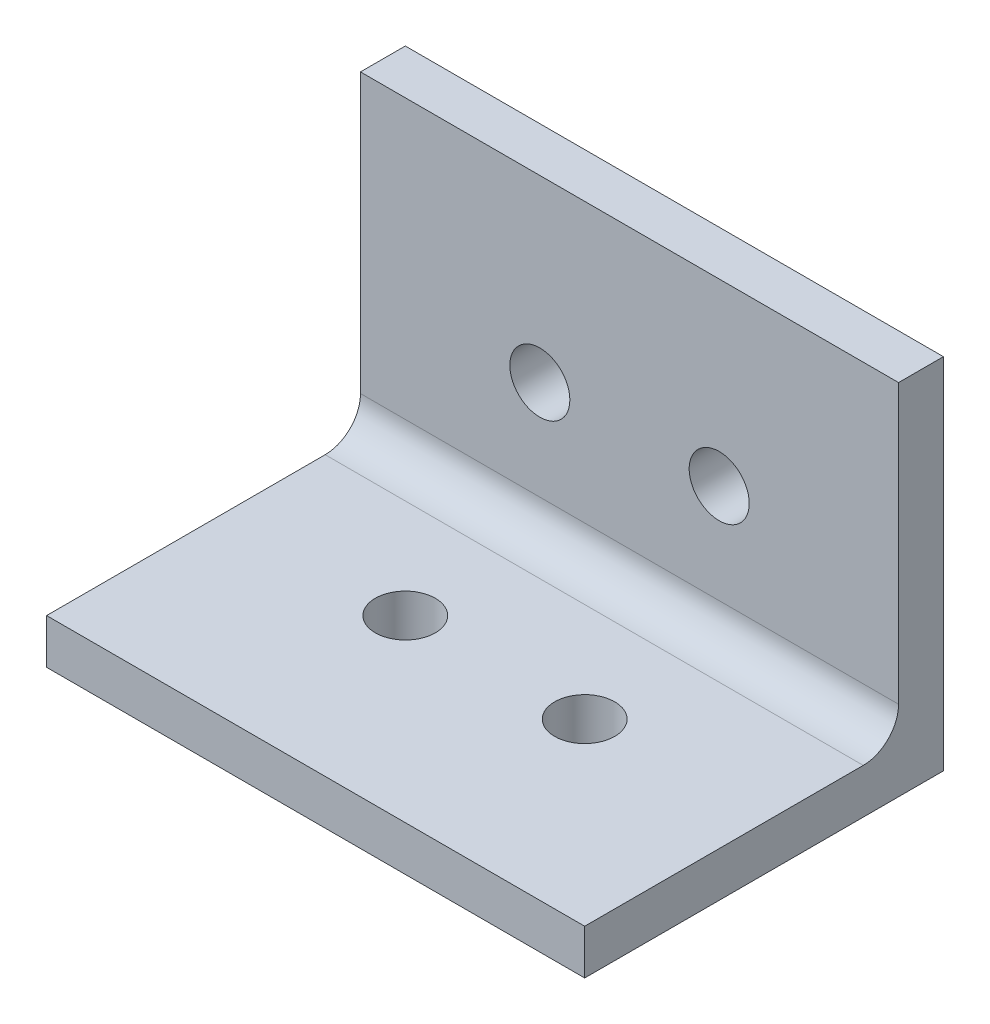
ISO-10303-21;
HEADER;
FILE_DESCRIPTION(('STEP AP214'),'2;1');
FILE_NAME('part.step','',(''),(''),'','','');
FILE_SCHEMA(('AUTOMOTIVE_DESIGN { 1 0 10303 214 1 1 1 1 }'));
ENDSEC;
DATA;
#1=APPLICATION_CONTEXT('core data for automotive mechanical design processes');
#2=APPLICATION_PROTOCOL_DEFINITION('international standard','automotive_design',2000,#1);
#3=PRODUCT_CONTEXT('',#1,'mechanical');
#4=PRODUCT('Part','Part','',(#3));
#5=PRODUCT_RELATED_PRODUCT_CATEGORY('part','',(#4));
#6=PRODUCT_DEFINITION_FORMATION('','',#4);
#7=PRODUCT_DEFINITION_CONTEXT('part definition',#1,'design');
#8=PRODUCT_DEFINITION('design','',#6,#7);
#9=PRODUCT_DEFINITION_SHAPE('','',#8);
#10=(LENGTH_UNIT() NAMED_UNIT(*) SI_UNIT(.MILLI.,.METRE.));
#11=(NAMED_UNIT(*) PLANE_ANGLE_UNIT() SI_UNIT($,.RADIAN.));
#12=(NAMED_UNIT(*) SI_UNIT($,.STERADIAN.) SOLID_ANGLE_UNIT());
#13=UNCERTAINTY_MEASURE_WITH_UNIT(LENGTH_MEASURE(1.E-05),#10,'distance_accuracy_value','');
#14=(GEOMETRIC_REPRESENTATION_CONTEXT(3) GLOBAL_UNCERTAINTY_ASSIGNED_CONTEXT((#13)) GLOBAL_UNIT_ASSIGNED_CONTEXT((#10,
#11,#12)) REPRESENTATION_CONTEXT('',''));
#15=CARTESIAN_POINT('',(0.,0.,0.));
#16=DIRECTION('',(0.,0.,1.));
#17=DIRECTION('',(1.,0.,0.));
#18=AXIS2_PLACEMENT_3D('',#15,#16,#17);
#19=CARTESIAN_POINT('',(76.2,0.,50.8));
#20=DIRECTION('',(0.,1.,0.));
#21=DIRECTION('',(0.,0.,1.));
#22=AXIS2_PLACEMENT_3D('',#19,#20,#21);
#23=PLANE('',#22);
#24=CARTESIAN_POINT('',(25.4,0.,25.4));
#25=DIRECTION('',(0.,1.,0.));
#26=DIRECTION('',(0.,0.,1.));
#27=AXIS2_PLACEMENT_3D('',#24,#25,#26);
#28=CIRCLE('',#27,4.25);
#29=CARTESIAN_POINT('',(25.4,0.,29.65));
#30=VERTEX_POINT('',#29);
#31=EDGE_CURVE('E153',#30,#30,#28,.T.);
#32=ORIENTED_EDGE('',*,*,#31,.T.);
#33=EDGE_LOOP('',(#32));
#34=FACE_BOUND('',#33,.T.);
#35=CARTESIAN_POINT('',(50.8,0.,25.4));
#36=DIRECTION('',(0.,1.,0.));
#37=DIRECTION('',(0.,0.,1.));
#38=AXIS2_PLACEMENT_3D('',#35,#36,#37);
#39=CIRCLE('',#38,4.25);
#40=CARTESIAN_POINT('',(50.8,0.,29.65));
#41=VERTEX_POINT('',#40);
#42=EDGE_CURVE('E141',#41,#41,#39,.T.);
#43=ORIENTED_EDGE('',*,*,#42,.T.);
#44=EDGE_LOOP('',(#43));
#45=FACE_BOUND('',#44,.T.);
#46=DIRECTION('',(0.,0.,-1.));
#47=VECTOR('',#46,1.);
#48=CARTESIAN_POINT('',(0.,0.,50.8));
#49=LINE('',#48,#47);
#50=CARTESIAN_POINT('',(0.,0.,50.8));
#51=VERTEX_POINT('',#50);
#52=CARTESIAN_POINT('',(0.,0.,0.));
#53=VERTEX_POINT('',#52);
#54=EDGE_CURVE('E115',#51,#53,#49,.T.);
#55=ORIENTED_EDGE('',*,*,#54,.T.);
#56=DIRECTION('',(-1.,0.,0.));
#57=VECTOR('',#56,1.);
#58=CARTESIAN_POINT('',(76.2,0.,0.));
#59=LINE('',#58,#57);
#60=CARTESIAN_POINT('',(76.2,0.,0.));
#61=VERTEX_POINT('',#60);
#62=EDGE_CURVE('E96',#61,#53,#59,.T.);
#63=ORIENTED_EDGE('',*,*,#62,.F.);
#64=DIRECTION('',(0.,0.,-1.));
#65=VECTOR('',#64,1.);
#66=CARTESIAN_POINT('',(76.2,0.,50.8));
#67=LINE('',#66,#65);
#68=CARTESIAN_POINT('',(76.2,0.,50.8));
#69=VERTEX_POINT('',#68);
#70=EDGE_CURVE('E103',#69,#61,#67,.T.);
#71=ORIENTED_EDGE('',*,*,#70,.F.);
#72=DIRECTION('',(-1.,0.,0.));
#73=VECTOR('',#72,1.);
#74=CARTESIAN_POINT('',(76.2,0.,50.8));
#75=LINE('',#74,#73);
#76=EDGE_CURVE('E129',#69,#51,#75,.T.);
#77=ORIENTED_EDGE('',*,*,#76,.T.);
#78=EDGE_LOOP('',(#55,#63,#71,#77));
#79=FACE_BOUND('',#78,.T.);
#80=ADVANCED_FACE('F33',(#34,#45,#79),#23,.F.);
#81=CARTESIAN_POINT('',(76.2,0.,0.));
#82=DIRECTION('',(0.,0.,1.));
#83=DIRECTION('',(1.,0.,0.));
#84=AXIS2_PLACEMENT_3D('',#81,#82,#83);
#85=PLANE('',#84);
#86=CARTESIAN_POINT('',(25.4,25.4,0.));
#87=DIRECTION('',(0.,0.,1.));
#88=DIRECTION('',(1.,0.,0.));
#89=AXIS2_PLACEMENT_3D('',#86,#87,#88);
#90=CIRCLE('',#89,4.24999999999999);
#91=CARTESIAN_POINT('',(29.65,25.4,0.));
#92=VERTEX_POINT('',#91);
#93=EDGE_CURVE('E165',#92,#92,#90,.T.);
#94=ORIENTED_EDGE('',*,*,#93,.T.);
#95=EDGE_LOOP('',(#94));
#96=FACE_BOUND('',#95,.T.);
#97=CARTESIAN_POINT('',(50.8,25.4,0.));
#98=DIRECTION('',(0.,0.,1.));
#99=DIRECTION('',(1.,0.,0.));
#100=AXIS2_PLACEMENT_3D('',#97,#98,#99);
#101=CIRCLE('',#100,4.24999999999999);
#102=CARTESIAN_POINT('',(55.05,25.4,0.));
#103=VERTEX_POINT('',#102);
#104=EDGE_CURVE('E159',#103,#103,#101,.T.);
#105=ORIENTED_EDGE('',*,*,#104,.T.);
#106=EDGE_LOOP('',(#105));
#107=FACE_BOUND('',#106,.T.);
#108=DIRECTION('',(0.,1.,0.));
#109=VECTOR('',#108,1.);
#110=CARTESIAN_POINT('',(0.,0.,0.));
#111=LINE('',#110,#109);
#112=CARTESIAN_POINT('',(0.,50.8,0.));
#113=VERTEX_POINT('',#112);
#114=EDGE_CURVE('E138',#53,#113,#111,.T.);
#115=ORIENTED_EDGE('',*,*,#114,.T.);
#116=DIRECTION('',(-1.,0.,0.));
#117=VECTOR('',#116,1.);
#118=CARTESIAN_POINT('',(76.2,50.8,0.));
#119=LINE('',#118,#117);
#120=CARTESIAN_POINT('',(76.2,50.8,0.));
#121=VERTEX_POINT('',#120);
#122=EDGE_CURVE('E99',#121,#113,#119,.T.);
#123=ORIENTED_EDGE('',*,*,#122,.F.);
#124=DIRECTION('',(0.,1.,0.));
#125=VECTOR('',#124,1.);
#126=CARTESIAN_POINT('',(76.2,0.,0.));
#127=LINE('',#126,#125);
#128=EDGE_CURVE('E92',#61,#121,#127,.T.);
#129=ORIENTED_EDGE('',*,*,#128,.F.);
#130=ORIENTED_EDGE('',*,*,#62,.T.);
#131=EDGE_LOOP('',(#115,#123,#129,#130));
#132=FACE_BOUND('',#131,.T.);
#133=ADVANCED_FACE('F94',(#96,#107,#132),#85,.F.);
#134=CARTESIAN_POINT('',(76.2,50.8,0.));
#135=DIRECTION('',(0.,-1.,0.));
#136=DIRECTION('',(0.,0.,-1.));
#137=AXIS2_PLACEMENT_3D('',#134,#135,#136);
#138=PLANE('',#137);
#139=DIRECTION('',(0.,0.,1.));
#140=VECTOR('',#139,1.);
#141=CARTESIAN_POINT('',(0.,50.8,0.));
#142=LINE('',#141,#140);
#143=CARTESIAN_POINT('',(0.,50.8,6.35));
#144=VERTEX_POINT('',#143);
#145=EDGE_CURVE('E136',#113,#144,#142,.T.);
#146=ORIENTED_EDGE('',*,*,#145,.T.);
#147=DIRECTION('',(-1.,0.,0.));
#148=VECTOR('',#147,1.);
#149=CARTESIAN_POINT('',(76.2,50.8,6.35));
#150=LINE('',#149,#148);
#151=CARTESIAN_POINT('',(76.2,50.8,6.35));
#152=VERTEX_POINT('',#151);
#153=EDGE_CURVE('E120',#152,#144,#150,.T.);
#154=ORIENTED_EDGE('',*,*,#153,.F.);
#155=DIRECTION('',(0.,0.,1.));
#156=VECTOR('',#155,1.);
#157=CARTESIAN_POINT('',(76.2,50.8,0.));
#158=LINE('',#157,#156);
#159=EDGE_CURVE('E102',#121,#152,#158,.T.);
#160=ORIENTED_EDGE('',*,*,#159,.F.);
#161=ORIENTED_EDGE('',*,*,#122,.T.);
#162=EDGE_LOOP('',(#146,#154,#160,#161));
#163=FACE_BOUND('',#162,.T.);
#164=ADVANCED_FACE('F179',(#163),#138,.F.);
#165=CARTESIAN_POINT('',(76.2,50.8,6.35));
#166=DIRECTION('',(0.,0.,-1.));
#167=DIRECTION('',(-1.,0.,0.));
#168=AXIS2_PLACEMENT_3D('',#165,#166,#167);
#169=PLANE('',#168);
#170=CARTESIAN_POINT('',(25.4,25.4,6.35));
#171=DIRECTION('',(0.,0.,1.));
#172=DIRECTION('',(1.,0.,0.));
#173=AXIS2_PLACEMENT_3D('',#170,#171,#172);
#174=CIRCLE('',#173,4.24999999999999);
#175=CARTESIAN_POINT('',(29.65,25.4,6.35));
#176=VERTEX_POINT('',#175);
#177=EDGE_CURVE('E168',#176,#176,#174,.T.);
#178=ORIENTED_EDGE('',*,*,#177,.F.);
#179=EDGE_LOOP('',(#178));
#180=FACE_BOUND('',#179,.T.);
#181=CARTESIAN_POINT('',(50.8,25.4,6.35));
#182=DIRECTION('',(0.,0.,1.));
#183=DIRECTION('',(1.,0.,0.));
#184=AXIS2_PLACEMENT_3D('',#181,#182,#183);
#185=CIRCLE('',#184,4.24999999999999);
#186=CARTESIAN_POINT('',(55.05,25.4,6.35));
#187=VERTEX_POINT('',#186);
#188=EDGE_CURVE('E162',#187,#187,#185,.T.);
#189=ORIENTED_EDGE('',*,*,#188,.F.);
#190=EDGE_LOOP('',(#189));
#191=FACE_BOUND('',#190,.T.);
#192=DIRECTION('',(0.,-1.,0.));
#193=VECTOR('',#192,1.);
#194=CARTESIAN_POINT('',(0.,50.8,6.35));
#195=LINE('',#194,#193);
#196=CARTESIAN_POINT('',(0.,11.35,6.35));
#197=VERTEX_POINT('',#196);
#198=EDGE_CURVE('E134',#144,#197,#195,.T.);
#199=ORIENTED_EDGE('',*,*,#198,.T.);
#200=DIRECTION('',(-1.,0.,0.));
#201=VECTOR('',#200,1.);
#202=CARTESIAN_POINT('',(76.2,11.35,6.35));
#203=LINE('',#202,#201);
#204=CARTESIAN_POINT('',(76.2,11.35,6.35));
#205=VERTEX_POINT('',#204);
#206=EDGE_CURVE('E48',#197,#205,#203,.F.);
#207=ORIENTED_EDGE('',*,*,#206,.T.);
#208=DIRECTION('',(0.,-1.,0.));
#209=VECTOR('',#208,1.);
#210=CARTESIAN_POINT('',(76.2,50.8,6.35));
#211=LINE('',#210,#209);
#212=EDGE_CURVE('E145',#152,#205,#211,.T.);
#213=ORIENTED_EDGE('',*,*,#212,.F.);
#214=ORIENTED_EDGE('',*,*,#153,.T.);
#215=EDGE_LOOP('',(#199,#207,#213,#214));
#216=FACE_BOUND('',#215,.T.);
#217=ADVANCED_FACE('F175',(#180,#191,#216),#169,.F.);
#218=CARTESIAN_POINT('',(76.2,6.35,6.35));
#219=DIRECTION('',(0.,-1.,0.));
#220=DIRECTION('',(0.,0.,-1.));
#221=AXIS2_PLACEMENT_3D('',#218,#219,#220);
#222=PLANE('',#221);
#223=CARTESIAN_POINT('',(25.4,6.35,25.4));
#224=DIRECTION('',(0.,1.,0.));
#225=DIRECTION('',(0.,0.,1.));
#226=AXIS2_PLACEMENT_3D('',#223,#224,#225);
#227=CIRCLE('',#226,4.24999999999999);
#228=CARTESIAN_POINT('',(25.4,6.35,29.65));
#229=VERTEX_POINT('',#228);
#230=EDGE_CURVE('E156',#229,#229,#227,.T.);
#231=ORIENTED_EDGE('',*,*,#230,.F.);
#232=EDGE_LOOP('',(#231));
#233=FACE_BOUND('',#232,.T.);
#234=CARTESIAN_POINT('',(50.8,6.35,25.4));
#235=DIRECTION('',(0.,1.,0.));
#236=DIRECTION('',(0.,0.,1.));
#237=AXIS2_PLACEMENT_3D('',#234,#235,#236);
#238=CIRCLE('',#237,4.24999999999999);
#239=CARTESIAN_POINT('',(50.8,6.35,29.65));
#240=VERTEX_POINT('',#239);
#241=EDGE_CURVE('E150',#240,#240,#238,.T.);
#242=ORIENTED_EDGE('',*,*,#241,.F.);
#243=EDGE_LOOP('',(#242));
#244=FACE_BOUND('',#243,.T.);
#245=DIRECTION('',(0.,0.,1.));
#246=VECTOR('',#245,1.);
#247=CARTESIAN_POINT('',(76.2,6.35,6.35));
#248=LINE('',#247,#246);
#249=CARTESIAN_POINT('',(76.2,6.35,11.35));
#250=VERTEX_POINT('',#249);
#251=CARTESIAN_POINT('',(76.2,6.34999999999999,50.8));
#252=VERTEX_POINT('',#251);
#253=EDGE_CURVE('E143',#250,#252,#248,.T.);
#254=ORIENTED_EDGE('',*,*,#253,.F.);
#255=DIRECTION('',(-1.,0.,0.));
#256=VECTOR('',#255,1.);
#257=CARTESIAN_POINT('',(0.,6.35,11.35));
#258=LINE('',#257,#256);
#259=CARTESIAN_POINT('',(0.,6.35,11.35));
#260=VERTEX_POINT('',#259);
#261=EDGE_CURVE('E116',#250,#260,#258,.T.);
#262=ORIENTED_EDGE('',*,*,#261,.T.);
#263=DIRECTION('',(0.,0.,1.));
#264=VECTOR('',#263,1.);
#265=CARTESIAN_POINT('',(0.,6.35,6.35));
#266=LINE('',#265,#264);
#267=CARTESIAN_POINT('',(0.,6.34999999999999,50.8));
#268=VERTEX_POINT('',#267);
#269=EDGE_CURVE('E132',#260,#268,#266,.T.);
#270=ORIENTED_EDGE('',*,*,#269,.T.);
#271=DIRECTION('',(-1.,0.,0.));
#272=VECTOR('',#271,1.);
#273=CARTESIAN_POINT('',(76.2,6.34999999999999,50.8));
#274=LINE('',#273,#272);
#275=EDGE_CURVE('E126',#252,#268,#274,.T.);
#276=ORIENTED_EDGE('',*,*,#275,.F.);
#277=EDGE_LOOP('',(#254,#262,#270,#276));
#278=FACE_BOUND('',#277,.T.);
#279=ADVANCED_FACE('F178',(#233,#244,#278),#222,.F.);
#280=CARTESIAN_POINT('',(76.2,6.34999999999999,50.8));
#281=DIRECTION('',(0.,0.,-1.));
#282=DIRECTION('',(-1.,0.,0.));
#283=AXIS2_PLACEMENT_3D('',#280,#281,#282);
#284=PLANE('',#283);
#285=DIRECTION('',(0.,-1.,0.));
#286=VECTOR('',#285,1.);
#287=CARTESIAN_POINT('',(0.,6.34999999999999,50.8));
#288=LINE('',#287,#286);
#289=EDGE_CURVE('E112',#268,#51,#288,.T.);
#290=ORIENTED_EDGE('',*,*,#289,.T.);
#291=ORIENTED_EDGE('',*,*,#76,.F.);
#292=DIRECTION('',(0.,-1.,0.));
#293=VECTOR('',#292,1.);
#294=CARTESIAN_POINT('',(76.2,6.34999999999999,50.8));
#295=LINE('',#294,#293);
#296=EDGE_CURVE('E108',#252,#69,#295,.T.);
#297=ORIENTED_EDGE('',*,*,#296,.F.);
#298=ORIENTED_EDGE('',*,*,#275,.T.);
#299=EDGE_LOOP('',(#290,#291,#297,#298));
#300=FACE_BOUND('',#299,.T.);
#301=ADVANCED_FACE('F192',(#300),#284,.F.);
#302=CARTESIAN_POINT('',(76.2,0.,0.));
#303=DIRECTION('',(1.,0.,0.));
#304=DIRECTION('',(0.,0.,-1.));
#305=AXIS2_PLACEMENT_3D('',#302,#303,#304);
#306=PLANE('',#305);
#307=ORIENTED_EDGE('',*,*,#70,.T.);
#308=ORIENTED_EDGE('',*,*,#128,.T.);
#309=ORIENTED_EDGE('',*,*,#159,.T.);
#310=ORIENTED_EDGE('',*,*,#212,.T.);
#311=CARTESIAN_POINT('',(76.2,11.35,11.35));
#312=DIRECTION('',(1.,0.,0.));
#313=DIRECTION('',(0.,0.,-1.));
#314=AXIS2_PLACEMENT_3D('',#311,#312,#313);
#315=CIRCLE('',#314,5.);
#316=EDGE_CURVE('E11',#205,#250,#315,.F.);
#317=ORIENTED_EDGE('',*,*,#316,.T.);
#318=ORIENTED_EDGE('',*,*,#253,.T.);
#319=ORIENTED_EDGE('',*,*,#296,.T.);
#320=EDGE_LOOP('',(#307,#308,#309,#310,#317,#318,#319));
#321=FACE_BOUND('',#320,.T.);
#322=ADVANCED_FACE('F106',(#321),#306,.T.);
#323=CARTESIAN_POINT('',(0.,0.,0.));
#324=DIRECTION('',(1.,0.,0.));
#325=DIRECTION('',(0.,0.,-1.));
#326=AXIS2_PLACEMENT_3D('',#323,#324,#325);
#327=PLANE('',#326);
#328=ORIENTED_EDGE('',*,*,#54,.F.);
#329=ORIENTED_EDGE('',*,*,#289,.F.);
#330=ORIENTED_EDGE('',*,*,#269,.F.);
#331=CARTESIAN_POINT('',(0.,11.35,11.35));
#332=DIRECTION('',(1.,0.,0.));
#333=DIRECTION('',(0.,0.,-1.));
#334=AXIS2_PLACEMENT_3D('',#331,#332,#333);
#335=CIRCLE('',#334,5.);
#336=EDGE_CURVE('E41',#260,#197,#335,.T.);
#337=ORIENTED_EDGE('',*,*,#336,.T.);
#338=ORIENTED_EDGE('',*,*,#198,.F.);
#339=ORIENTED_EDGE('',*,*,#145,.F.);
#340=ORIENTED_EDGE('',*,*,#114,.F.);
#341=EDGE_LOOP('',(#328,#329,#330,#337,#338,#339,#340));
#342=FACE_BOUND('',#341,.T.);
#343=ADVANCED_FACE('F193',(#342),#327,.F.);
#344=CARTESIAN_POINT('',(50.8,6.35,25.4));
#345=DIRECTION('',(0.,1.,0.));
#346=DIRECTION('',(0.,0.,1.));
#347=AXIS2_PLACEMENT_3D('',#344,#345,#346);
#348=CYLINDRICAL_SURFACE('',#347,4.24999999999999);
#349=ORIENTED_EDGE('',*,*,#42,.F.);
#350=EDGE_LOOP('',(#349));
#351=FACE_BOUND('',#350,.T.);
#352=ORIENTED_EDGE('',*,*,#241,.T.);
#353=EDGE_LOOP('',(#352));
#354=FACE_BOUND('',#353,.T.);
#355=ADVANCED_FACE('F210',(#351,#354),#348,.F.);
#356=CARTESIAN_POINT('',(25.4,6.35,25.4));
#357=DIRECTION('',(0.,1.,0.));
#358=DIRECTION('',(0.,0.,1.));
#359=AXIS2_PLACEMENT_3D('',#356,#357,#358);
#360=CYLINDRICAL_SURFACE('',#359,4.24999999999999);
#361=ORIENTED_EDGE('',*,*,#31,.F.);
#362=EDGE_LOOP('',(#361));
#363=FACE_BOUND('',#362,.T.);
#364=ORIENTED_EDGE('',*,*,#230,.T.);
#365=EDGE_LOOP('',(#364));
#366=FACE_BOUND('',#365,.T.);
#367=ADVANCED_FACE('F213',(#363,#366),#360,.F.);
#368=CARTESIAN_POINT('',(50.8,25.4,6.35));
#369=DIRECTION('',(0.,0.,1.));
#370=DIRECTION('',(1.,0.,0.));
#371=AXIS2_PLACEMENT_3D('',#368,#369,#370);
#372=CYLINDRICAL_SURFACE('',#371,4.24999999999999);
#373=ORIENTED_EDGE('',*,*,#188,.T.);
#374=EDGE_LOOP('',(#373));
#375=FACE_BOUND('',#374,.T.);
#376=ORIENTED_EDGE('',*,*,#104,.F.);
#377=EDGE_LOOP('',(#376));
#378=FACE_BOUND('',#377,.T.);
#379=ADVANCED_FACE('F232',(#375,#378),#372,.F.);
#380=CARTESIAN_POINT('',(25.4,25.4,6.35));
#381=DIRECTION('',(0.,0.,1.));
#382=DIRECTION('',(1.,0.,0.));
#383=AXIS2_PLACEMENT_3D('',#380,#381,#382);
#384=CYLINDRICAL_SURFACE('',#383,4.24999999999999);
#385=ORIENTED_EDGE('',*,*,#177,.T.);
#386=EDGE_LOOP('',(#385));
#387=FACE_BOUND('',#386,.T.);
#388=ORIENTED_EDGE('',*,*,#93,.F.);
#389=EDGE_LOOP('',(#388));
#390=FACE_BOUND('',#389,.T.);
#391=ADVANCED_FACE('F172',(#387,#390),#384,.F.);
#392=CARTESIAN_POINT('',(76.2,11.35,11.35));
#393=DIRECTION('',(1.,0.,0.));
#394=DIRECTION('',(0.,0.,-1.));
#395=AXIS2_PLACEMENT_3D('',#392,#393,#394);
#396=CYLINDRICAL_SURFACE('',#395,5.);
#397=ORIENTED_EDGE('',*,*,#316,.F.);
#398=ORIENTED_EDGE('',*,*,#206,.F.);
#399=ORIENTED_EDGE('',*,*,#336,.F.);
#400=ORIENTED_EDGE('',*,*,#261,.F.);
#401=EDGE_LOOP('',(#397,#398,#399,#400));
#402=FACE_BOUND('',#401,.T.);
#403=ADVANCED_FACE('F35',(#402),#396,.F.);
#404=CLOSED_SHELL('',(#80,#133,#164,#217,#279,#301,#322,#343,#355,#367,#379,#391,#403));
#405=MANIFOLD_SOLID_BREP('B2',#404);
#406=ADVANCED_BREP_SHAPE_REPRESENTATION('',(#18,#405),#14);
#407=SHAPE_DEFINITION_REPRESENTATION(#9,#406);
ENDSEC;
END-ISO-10303-21;
